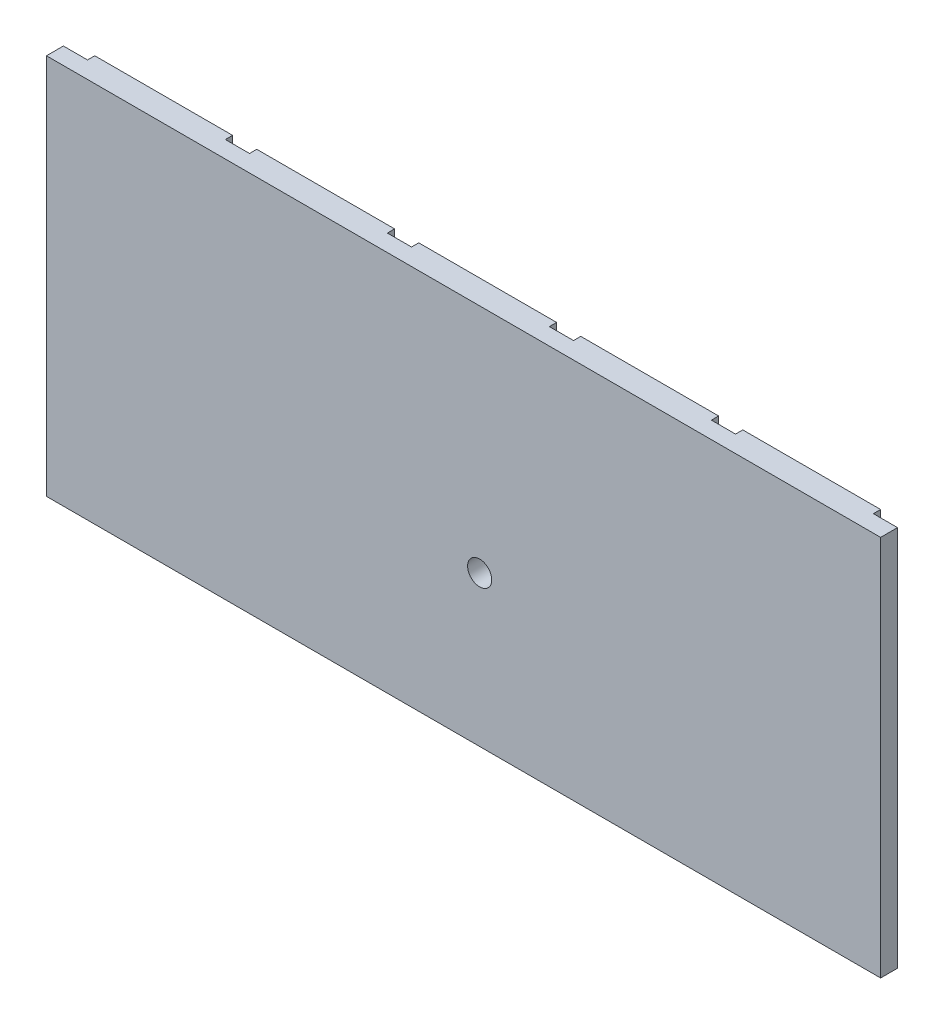
ISO-10303-21;
HEADER;
FILE_DESCRIPTION(('STEP AP214'),'2;1');
FILE_NAME('part.step','',(''),(''),'','','');
FILE_SCHEMA(('AUTOMOTIVE_DESIGN { 1 0 10303 214 1 1 1 1 }'));
ENDSEC;
DATA;
#1=APPLICATION_CONTEXT('core data for automotive mechanical design processes');
#2=APPLICATION_PROTOCOL_DEFINITION('international standard','automotive_design',2000,#1);
#3=PRODUCT_CONTEXT('',#1,'mechanical');
#4=PRODUCT('Part','Part','',(#3));
#5=PRODUCT_RELATED_PRODUCT_CATEGORY('part','',(#4));
#6=PRODUCT_DEFINITION_FORMATION('','',#4);
#7=PRODUCT_DEFINITION_CONTEXT('part definition',#1,'design');
#8=PRODUCT_DEFINITION('design','',#6,#7);
#9=PRODUCT_DEFINITION_SHAPE('','',#8);
#10=(LENGTH_UNIT() NAMED_UNIT(*) SI_UNIT(.MILLI.,.METRE.));
#11=(NAMED_UNIT(*) PLANE_ANGLE_UNIT() SI_UNIT($,.RADIAN.));
#12=(NAMED_UNIT(*) SI_UNIT($,.STERADIAN.) SOLID_ANGLE_UNIT());
#13=UNCERTAINTY_MEASURE_WITH_UNIT(LENGTH_MEASURE(1.E-05),#10,'distance_accuracy_value','');
#14=(GEOMETRIC_REPRESENTATION_CONTEXT(3) GLOBAL_UNCERTAINTY_ASSIGNED_CONTEXT((#13)) GLOBAL_UNIT_ASSIGNED_CONTEXT((#10,
#11,#12)) REPRESENTATION_CONTEXT('',''));
#15=CARTESIAN_POINT('',(0.,0.,0.));
#16=DIRECTION('',(0.,0.,1.));
#17=DIRECTION('',(1.,0.,0.));
#18=AXIS2_PLACEMENT_3D('',#15,#16,#17);
#19=CARTESIAN_POINT('',(0.,0.,0.));
#20=DIRECTION('',(0.,0.,-1.));
#21=DIRECTION('',(-1.,0.,0.));
#22=AXIS2_PLACEMENT_3D('',#19,#20,#21);
#23=PLANE('',#22);
#24=DIRECTION('',(0.,1.,0.));
#25=VECTOR('',#24,1.);
#26=CARTESIAN_POINT('',(-47.8064909033683,-39.501,9.36768929129558E-13));
#27=LINE('',#26,#25);
#28=CARTESIAN_POINT('',(-47.8064909033683,-39.4999999999999,9.36768929129558E-13));
#29=VERTEX_POINT('',#28);
#30=CARTESIAN_POINT('',(-47.8064909033683,39.4999999999999,9.36768929129558E-13));
#31=VERTEX_POINT('',#30);
#32=EDGE_CURVE('E342',#29,#31,#27,.T.);
#33=ORIENTED_EDGE('',*,*,#32,.T.);
#34=DIRECTION('',(-1.,0.,0.));
#35=VECTOR('',#34,1.);
#36=CARTESIAN_POINT('',(-86.3441515056138,39.4999999999999,0.));
#37=LINE('',#36,#35);
#38=CARTESIAN_POINT('',(-19.2688303011227,39.4999999999999,7.03495181946529E-13));
#39=VERTEX_POINT('',#38);
#40=EDGE_CURVE('E377',#39,#31,#37,.T.);
#41=ORIENTED_EDGE('',*,*,#40,.F.);
#42=DIRECTION('',(0.,1.,0.));
#43=VECTOR('',#42,1.);
#44=CARTESIAN_POINT('',(-19.2688303011227,-39.501,7.03495181946529E-13));
#45=LINE('',#44,#43);
#46=CARTESIAN_POINT('',(-19.2688303011228,-39.4999999999999,0.));
#47=VERTEX_POINT('',#46);
#48=EDGE_CURVE('E318',#47,#39,#45,.T.);
#49=ORIENTED_EDGE('',*,*,#48,.F.);
#50=DIRECTION('',(1.,0.,0.));
#51=VECTOR('',#50,1.);
#52=CARTESIAN_POINT('',(-86.3441515056138,-39.4999999999999,0.));
#53=LINE('',#52,#51);
#54=EDGE_CURVE('E228',#29,#47,#53,.T.);
#55=ORIENTED_EDGE('',*,*,#54,.F.);
#56=EDGE_LOOP('',(#33,#41,#49,#55));
#57=FACE_BOUND('',#56,.T.);
#58=ADVANCED_FACE('F35',(#57),#23,.T.);
#59=DIRECTION('',(0.,1.,0.));
#60=VECTOR('',#59,1.);
#61=CARTESIAN_POINT('',(-14.2688303011227,-39.501,7.02576696847169E-13));
#62=LINE('',#61,#60);
#63=CARTESIAN_POINT('',(-14.2688303011227,-39.4999999999999,7.02576696847169E-13));
#64=VERTEX_POINT('',#63);
#65=CARTESIAN_POINT('',(-14.2688303011227,39.4999999999999,7.02576696847169E-13));
#66=VERTEX_POINT('',#65);
#67=EDGE_CURVE('E317',#64,#66,#62,.T.);
#68=ORIENTED_EDGE('',*,*,#67,.T.);
#69=CARTESIAN_POINT('',(14.2688303011228,39.4999999999999,4.6930294966414E-13));
#70=VERTEX_POINT('',#69);
#71=EDGE_CURVE('E379',#70,#66,#37,.T.);
#72=ORIENTED_EDGE('',*,*,#71,.F.);
#73=DIRECTION('',(0.,1.,0.));
#74=VECTOR('',#73,1.);
#75=CARTESIAN_POINT('',(14.2688303011228,-39.501,4.6930294966414E-13));
#76=LINE('',#75,#74);
#77=CARTESIAN_POINT('',(14.2688303011228,-39.4999999999999,0.));
#78=VERTEX_POINT('',#77);
#79=EDGE_CURVE('E293',#78,#70,#76,.T.);
#80=ORIENTED_EDGE('',*,*,#79,.F.);
#81=EDGE_CURVE('E416',#64,#78,#53,.T.);
#82=ORIENTED_EDGE('',*,*,#81,.F.);
#83=EDGE_LOOP('',(#68,#72,#80,#82));
#84=FACE_BOUND('',#83,.T.);
#85=CARTESIAN_POINT('',(3.3372047050014,-8.38677821628897,0.));
#86=DIRECTION('',(0.,0.,1.));
#87=DIRECTION('',(1.,0.,0.));
#88=AXIS2_PLACEMENT_3D('',#85,#86,#87);
#89=CIRCLE('',#88,2.5);
#90=CARTESIAN_POINT('',(5.8372047050014,-8.38677821628897,0.));
#91=VERTEX_POINT('',#90);
#92=EDGE_CURVE('E241',#91,#91,#89,.T.);
#93=ORIENTED_EDGE('',*,*,#92,.T.);
#94=EDGE_LOOP('',(#93));
#95=FACE_BOUND('',#94,.T.);
#96=ADVANCED_FACE('F413',(#84,#95),#23,.T.);
#97=DIRECTION('',(0.,1.,0.));
#98=VECTOR('',#97,1.);
#99=CARTESIAN_POINT('',(19.2688303011228,-39.501,4.68384464564779E-13));
#100=LINE('',#99,#98);
#101=CARTESIAN_POINT('',(19.2688303011228,-39.4999999999999,4.68384464564779E-13));
#102=VERTEX_POINT('',#101);
#103=CARTESIAN_POINT('',(19.2688303011228,39.4999999999999,4.68384464564779E-13));
#104=VERTEX_POINT('',#103);
#105=EDGE_CURVE('E292',#102,#104,#100,.T.);
#106=ORIENTED_EDGE('',*,*,#105,.T.);
#107=CARTESIAN_POINT('',(47.8064909033683,39.4999999999999,2.3511071738175E-13));
#108=VERTEX_POINT('',#107);
#109=EDGE_CURVE('E233',#108,#104,#37,.T.);
#110=ORIENTED_EDGE('',*,*,#109,.F.);
#111=DIRECTION('',(0.,1.,0.));
#112=VECTOR('',#111,1.);
#113=CARTESIAN_POINT('',(47.8064909033683,-39.501,2.3511071738175E-13));
#114=LINE('',#113,#112);
#115=CARTESIAN_POINT('',(47.8064909033683,-39.4999999999999,0.));
#116=VERTEX_POINT('',#115);
#117=EDGE_CURVE('E268',#116,#108,#114,.T.);
#118=ORIENTED_EDGE('',*,*,#117,.F.);
#119=EDGE_CURVE('E397',#102,#116,#53,.T.);
#120=ORIENTED_EDGE('',*,*,#119,.F.);
#121=EDGE_LOOP('',(#106,#110,#118,#120));
#122=FACE_BOUND('',#121,.T.);
#123=ADVANCED_FACE('F395',(#122),#23,.T.);
#124=DIRECTION('',(0.,1.,0.));
#125=VECTOR('',#124,1.);
#126=CARTESIAN_POINT('',(52.8064909033683,-39.501,2.3419223228239E-13));
#127=LINE('',#126,#125);
#128=CARTESIAN_POINT('',(52.8064909033683,-39.4999999999999,2.3419223228239E-13));
#129=VERTEX_POINT('',#128);
#130=CARTESIAN_POINT('',(52.8064909033683,39.4999999999999,2.3419223228239E-13));
#131=VERTEX_POINT('',#130);
#132=EDGE_CURVE('E267',#129,#131,#127,.T.);
#133=ORIENTED_EDGE('',*,*,#132,.T.);
#134=CARTESIAN_POINT('',(81.3441515056138,39.4999999999999,0.));
#135=VERTEX_POINT('',#134);
#136=EDGE_CURVE('E230',#135,#131,#37,.T.);
#137=ORIENTED_EDGE('',*,*,#136,.F.);
#138=DIRECTION('',(0.,1.,0.));
#139=VECTOR('',#138,1.);
#140=CARTESIAN_POINT('',(81.3441515056138,-39.501,0.));
#141=LINE('',#140,#139);
#142=CARTESIAN_POINT('',(81.3441515056138,-39.4999999999999,0.));
#143=VERTEX_POINT('',#142);
#144=EDGE_CURVE('E251',#143,#135,#141,.T.);
#145=ORIENTED_EDGE('',*,*,#144,.F.);
#146=EDGE_CURVE('E229',#129,#143,#53,.T.);
#147=ORIENTED_EDGE('',*,*,#146,.F.);
#148=EDGE_LOOP('',(#133,#137,#145,#147));
#149=FACE_BOUND('',#148,.T.);
#150=ADVANCED_FACE('F455',(#149),#23,.T.);
#151=CARTESIAN_POINT('',(0.,0.,5.));
#152=DIRECTION('',(0.,0.,-1.));
#153=DIRECTION('',(-1.,0.,0.));
#154=AXIS2_PLACEMENT_3D('',#151,#152,#153);
#155=PLANE('',#154);
#156=DIRECTION('',(0.,1.,0.));
#157=VECTOR('',#156,1.);
#158=CARTESIAN_POINT('',(86.3441515056138,-39.4999999999999,5.));
#159=LINE('',#158,#157);
#160=CARTESIAN_POINT('',(86.3441515056138,-39.4999999999999,5.));
#161=VERTEX_POINT('',#160);
#162=CARTESIAN_POINT('',(86.3441515056138,39.4999999999999,5.));
#163=VERTEX_POINT('',#162);
#164=EDGE_CURVE('E227',#161,#163,#159,.T.);
#165=ORIENTED_EDGE('',*,*,#164,.T.);
#166=DIRECTION('',(-1.,0.,0.));
#167=VECTOR('',#166,1.);
#168=CARTESIAN_POINT('',(-86.3441515056138,39.4999999999999,5.));
#169=LINE('',#168,#167);
#170=CARTESIAN_POINT('',(-86.3441515056138,39.4999999999999,5.));
#171=VERTEX_POINT('',#170);
#172=EDGE_CURVE('E237',#163,#171,#169,.T.);
#173=ORIENTED_EDGE('',*,*,#172,.T.);
#174=DIRECTION('',(0.,-1.,0.));
#175=VECTOR('',#174,1.);
#176=CARTESIAN_POINT('',(-86.3441515056138,-39.4999999999999,5.));
#177=LINE('',#176,#175);
#178=CARTESIAN_POINT('',(-86.3441515056138,-39.4999999999999,5.));
#179=VERTEX_POINT('',#178);
#180=EDGE_CURVE('E217',#171,#179,#177,.T.);
#181=ORIENTED_EDGE('',*,*,#180,.T.);
#182=DIRECTION('',(1.,0.,0.));
#183=VECTOR('',#182,1.);
#184=CARTESIAN_POINT('',(-86.3441515056138,-39.4999999999999,5.));
#185=LINE('',#184,#183);
#186=EDGE_CURVE('E224',#179,#161,#185,.T.);
#187=ORIENTED_EDGE('',*,*,#186,.T.);
#188=EDGE_LOOP('',(#165,#173,#181,#187));
#189=FACE_BOUND('',#188,.T.);
#190=CARTESIAN_POINT('',(3.3372047050014,-8.38677821628897,5.));
#191=DIRECTION('',(0.,0.,1.));
#192=DIRECTION('',(1.,0.,0.));
#193=AXIS2_PLACEMENT_3D('',#190,#191,#192);
#194=CIRCLE('',#193,2.5);
#195=CARTESIAN_POINT('',(5.8372047050014,-8.38677821628897,5.));
#196=VERTEX_POINT('',#195);
#197=EDGE_CURVE('E244',#196,#196,#194,.T.);
#198=ORIENTED_EDGE('',*,*,#197,.F.);
#199=EDGE_LOOP('',(#198));
#200=FACE_BOUND('',#199,.T.);
#201=ADVANCED_FACE('F454',(#189,#200),#155,.F.);
#202=DIRECTION('',(0.,1.,0.));
#203=VECTOR('',#202,1.);
#204=CARTESIAN_POINT('',(-81.3441515056138,-39.501,1.17096116141195E-12));
#205=LINE('',#204,#203);
#206=CARTESIAN_POINT('',(-81.3441515056138,-39.4999999999999,1.17096116141195E-12));
#207=VERTEX_POINT('',#206);
#208=CARTESIAN_POINT('',(-81.3441515056138,39.4999999999999,1.17096116141195E-12));
#209=VERTEX_POINT('',#208);
#210=EDGE_CURVE('E362',#207,#209,#205,.T.);
#211=ORIENTED_EDGE('',*,*,#210,.T.);
#212=CARTESIAN_POINT('',(-52.8064909033683,39.4999999999999,9.37687414228919E-13));
#213=VERTEX_POINT('',#212);
#214=EDGE_CURVE('E234',#213,#209,#37,.T.);
#215=ORIENTED_EDGE('',*,*,#214,.F.);
#216=DIRECTION('',(0.,1.,0.));
#217=VECTOR('',#216,1.);
#218=CARTESIAN_POINT('',(-52.8064909033683,-39.501,9.37687414228919E-13));
#219=LINE('',#218,#217);
#220=CARTESIAN_POINT('',(-52.8064909033683,-39.4999999999999,0.));
#221=VERTEX_POINT('',#220);
#222=EDGE_CURVE('E343',#221,#213,#219,.T.);
#223=ORIENTED_EDGE('',*,*,#222,.F.);
#224=EDGE_CURVE('E225',#207,#221,#53,.T.);
#225=ORIENTED_EDGE('',*,*,#224,.F.);
#226=EDGE_LOOP('',(#211,#215,#223,#225));
#227=FACE_BOUND('',#226,.T.);
#228=ADVANCED_FACE('F373',(#227),#23,.T.);
#229=CARTESIAN_POINT('',(86.3441515056138,-39.4999999999999,5.));
#230=DIRECTION('',(-1.,0.,0.));
#231=DIRECTION('',(0.,-1.,0.));
#232=AXIS2_PLACEMENT_3D('',#229,#230,#231);
#233=PLANE('',#232);
#234=DIRECTION('',(0.,0.,-1.));
#235=VECTOR('',#234,1.);
#236=CARTESIAN_POINT('',(86.3441515056138,-39.4999999999999,5.));
#237=LINE('',#236,#235);
#238=CARTESIAN_POINT('',(86.3441515056138,-39.4999999999999,1.5));
#239=VERTEX_POINT('',#238);
#240=EDGE_CURVE('E219',#161,#239,#237,.T.);
#241=ORIENTED_EDGE('',*,*,#240,.T.);
#242=DIRECTION('',(0.,1.,0.));
#243=VECTOR('',#242,1.);
#244=CARTESIAN_POINT('',(86.3441515056138,-39.501,1.5));
#245=LINE('',#244,#243);
#246=CARTESIAN_POINT('',(86.3441515056138,39.4999999999999,1.5));
#247=VERTEX_POINT('',#246);
#248=EDGE_CURVE('E250',#239,#247,#245,.T.);
#249=ORIENTED_EDGE('',*,*,#248,.T.);
#250=DIRECTION('',(0.,0.,-1.));
#251=VECTOR('',#250,1.);
#252=CARTESIAN_POINT('',(86.3441515056138,39.4999999999999,5.));
#253=LINE('',#252,#251);
#254=EDGE_CURVE('E11',#163,#247,#253,.T.);
#255=ORIENTED_EDGE('',*,*,#254,.F.);
#256=ORIENTED_EDGE('',*,*,#164,.F.);
#257=EDGE_LOOP('',(#241,#249,#255,#256));
#258=FACE_BOUND('',#257,.T.);
#259=ADVANCED_FACE('F37',(#258),#233,.F.);
#260=CARTESIAN_POINT('',(-86.3441515056138,39.4999999999999,5.));
#261=DIRECTION('',(0.,-1.,0.));
#262=DIRECTION('',(1.,0.,0.));
#263=AXIS2_PLACEMENT_3D('',#260,#261,#262);
#264=PLANE('',#263);
#265=ORIENTED_EDGE('',*,*,#214,.T.);
#266=DIRECTION('',(0.,0.,-1.));
#267=VECTOR('',#266,1.);
#268=CARTESIAN_POINT('',(-81.3441515056138,39.4999999999999,1.17096116141195E-12));
#269=LINE('',#268,#267);
#270=CARTESIAN_POINT('',(-81.3441515056138,39.4999999999999,1.50000000000117));
#271=VERTEX_POINT('',#270);
#272=EDGE_CURVE('E208',#271,#209,#269,.T.);
#273=ORIENTED_EDGE('',*,*,#272,.F.);
#274=DIRECTION('',(1.,0.,0.));
#275=VECTOR('',#274,1.);
#276=CARTESIAN_POINT('',(-81.3441515056138,39.4999999999999,1.50000000000117));
#277=LINE('',#276,#275);
#278=CARTESIAN_POINT('',(-86.3441515056138,39.4999999999999,1.50000000000119));
#279=VERTEX_POINT('',#278);
#280=EDGE_CURVE('E199',#279,#271,#277,.T.);
#281=ORIENTED_EDGE('',*,*,#280,.F.);
#282=DIRECTION('',(0.,0.,-1.));
#283=VECTOR('',#282,1.);
#284=CARTESIAN_POINT('',(-86.3441515056138,39.4999999999999,5.));
#285=LINE('',#284,#283);
#286=EDGE_CURVE('E43',#171,#279,#285,.T.);
#287=ORIENTED_EDGE('',*,*,#286,.F.);
#288=ORIENTED_EDGE('',*,*,#172,.F.);
#289=ORIENTED_EDGE('',*,*,#254,.T.);
#290=DIRECTION('',(1.,0.,0.));
#291=VECTOR('',#290,1.);
#292=CARTESIAN_POINT('',(86.3441515056138,39.4999999999999,1.5));
#293=LINE('',#292,#291);
#294=CARTESIAN_POINT('',(81.3441515056138,39.4999999999999,1.5));
#295=VERTEX_POINT('',#294);
#296=EDGE_CURVE('E254',#295,#247,#293,.T.);
#297=ORIENTED_EDGE('',*,*,#296,.F.);
#298=DIRECTION('',(0.,0.,1.));
#299=VECTOR('',#298,1.);
#300=CARTESIAN_POINT('',(81.3441515056138,39.4999999999999,0.));
#301=LINE('',#300,#299);
#302=EDGE_CURVE('E259',#135,#295,#301,.T.);
#303=ORIENTED_EDGE('',*,*,#302,.F.);
#304=ORIENTED_EDGE('',*,*,#136,.T.);
#305=DIRECTION('',(0.,0.,-1.));
#306=VECTOR('',#305,1.);
#307=CARTESIAN_POINT('',(52.8064909033683,39.4999999999999,2.3419223228239E-13));
#308=LINE('',#307,#306);
#309=CARTESIAN_POINT('',(52.8064909033683,39.4999999999999,1.50000000000023));
#310=VERTEX_POINT('',#309);
#311=EDGE_CURVE('E271',#310,#131,#308,.T.);
#312=ORIENTED_EDGE('',*,*,#311,.F.);
#313=DIRECTION('',(1.,0.,0.));
#314=VECTOR('',#313,1.);
#315=CARTESIAN_POINT('',(52.8064909033683,39.4999999999999,1.50000000000023));
#316=LINE('',#315,#314);
#317=CARTESIAN_POINT('',(47.8064909033683,39.4999999999999,1.50000000000024));
#318=VERTEX_POINT('',#317);
#319=EDGE_CURVE('E278',#318,#310,#316,.T.);
#320=ORIENTED_EDGE('',*,*,#319,.F.);
#321=DIRECTION('',(0.,0.,1.));
#322=VECTOR('',#321,1.);
#323=CARTESIAN_POINT('',(47.8064909033683,39.4999999999999,2.3511071738175E-13));
#324=LINE('',#323,#322);
#325=EDGE_CURVE('E281',#108,#318,#324,.T.);
#326=ORIENTED_EDGE('',*,*,#325,.F.);
#327=ORIENTED_EDGE('',*,*,#109,.T.);
#328=DIRECTION('',(0.,0.,-1.));
#329=VECTOR('',#328,1.);
#330=CARTESIAN_POINT('',(19.2688303011228,39.4999999999999,4.68384464564779E-13));
#331=LINE('',#330,#329);
#332=CARTESIAN_POINT('',(19.2688303011228,39.4999999999999,1.50000000000047));
#333=VERTEX_POINT('',#332);
#334=EDGE_CURVE('E296',#333,#104,#331,.T.);
#335=ORIENTED_EDGE('',*,*,#334,.F.);
#336=DIRECTION('',(1.,0.,0.));
#337=VECTOR('',#336,1.);
#338=CARTESIAN_POINT('',(19.2688303011228,39.4999999999999,1.50000000000047));
#339=LINE('',#338,#337);
#340=CARTESIAN_POINT('',(14.2688303011228,39.4999999999999,1.50000000000047));
#341=VERTEX_POINT('',#340);
#342=EDGE_CURVE('E303',#341,#333,#339,.T.);
#343=ORIENTED_EDGE('',*,*,#342,.F.);
#344=DIRECTION('',(0.,0.,1.));
#345=VECTOR('',#344,1.);
#346=CARTESIAN_POINT('',(14.2688303011228,39.4999999999999,4.6930294966414E-13));
#347=LINE('',#346,#345);
#348=EDGE_CURVE('E306',#70,#341,#347,.T.);
#349=ORIENTED_EDGE('',*,*,#348,.F.);
#350=ORIENTED_EDGE('',*,*,#71,.T.);
#351=DIRECTION('',(0.,0.,-1.));
#352=VECTOR('',#351,1.);
#353=CARTESIAN_POINT('',(-14.2688303011227,39.4999999999999,7.02576696847169E-13));
#354=LINE('',#353,#352);
#355=CARTESIAN_POINT('',(-14.2688303011227,39.4999999999999,1.5000000000007));
#356=VERTEX_POINT('',#355);
#357=EDGE_CURVE('E321',#356,#66,#354,.T.);
#358=ORIENTED_EDGE('',*,*,#357,.F.);
#359=DIRECTION('',(1.,0.,0.));
#360=VECTOR('',#359,1.);
#361=CARTESIAN_POINT('',(-14.2688303011227,39.4999999999999,1.5000000000007));
#362=LINE('',#361,#360);
#363=CARTESIAN_POINT('',(-19.2688303011227,39.4999999999999,1.5000000000007));
#364=VERTEX_POINT('',#363);
#365=EDGE_CURVE('E328',#364,#356,#362,.T.);
#366=ORIENTED_EDGE('',*,*,#365,.F.);
#367=DIRECTION('',(0.,0.,1.));
#368=VECTOR('',#367,1.);
#369=CARTESIAN_POINT('',(-19.2688303011227,39.4999999999999,7.03495181946529E-13));
#370=LINE('',#369,#368);
#371=EDGE_CURVE('E331',#39,#364,#370,.T.);
#372=ORIENTED_EDGE('',*,*,#371,.F.);
#373=ORIENTED_EDGE('',*,*,#40,.T.);
#374=DIRECTION('',(0.,0.,-1.));
#375=VECTOR('',#374,1.);
#376=CARTESIAN_POINT('',(-47.8064909033683,39.4999999999999,9.36768929129558E-13));
#377=LINE('',#376,#375);
#378=CARTESIAN_POINT('',(-47.8064909033683,39.4999999999999,1.50000000000094));
#379=VERTEX_POINT('',#378);
#380=EDGE_CURVE('E346',#379,#31,#377,.T.);
#381=ORIENTED_EDGE('',*,*,#380,.F.);
#382=DIRECTION('',(1.,0.,0.));
#383=VECTOR('',#382,1.);
#384=CARTESIAN_POINT('',(-47.8064909033683,39.4999999999999,1.50000000000094));
#385=LINE('',#384,#383);
#386=CARTESIAN_POINT('',(-52.8064909033683,39.4999999999999,1.50000000000094));
#387=VERTEX_POINT('',#386);
#388=EDGE_CURVE('E353',#387,#379,#385,.T.);
#389=ORIENTED_EDGE('',*,*,#388,.F.);
#390=DIRECTION('',(0.,0.,1.));
#391=VECTOR('',#390,1.);
#392=CARTESIAN_POINT('',(-52.8064909033683,39.4999999999999,9.37687414228919E-13));
#393=LINE('',#392,#391);
#394=EDGE_CURVE('E356',#213,#387,#393,.T.);
#395=ORIENTED_EDGE('',*,*,#394,.F.);
#396=EDGE_LOOP('',(#265,#273,#281,#287,#288,#289,#297,#303,#304,#312,#320,#326,#327,#335,#343,
#349,#350,#358,#366,#372,#373,#381,#389,#395));
#397=FACE_BOUND('',#396,.T.);
#398=ADVANCED_FACE('F213',(#397),#264,.F.);
#399=CARTESIAN_POINT('',(-86.3441515056138,-39.4999999999999,5.));
#400=DIRECTION('',(1.,0.,0.));
#401=DIRECTION('',(0.,1.,0.));
#402=AXIS2_PLACEMENT_3D('',#399,#400,#401);
#403=PLANE('',#402);
#404=ORIENTED_EDGE('',*,*,#286,.T.);
#405=DIRECTION('',(0.,1.,0.));
#406=VECTOR('',#405,1.);
#407=CARTESIAN_POINT('',(-86.3441515056138,-39.501,1.50000000000119));
#408=LINE('',#407,#406);
#409=CARTESIAN_POINT('',(-86.3441515056138,-39.4999999999999,1.50000000000119));
#410=VERTEX_POINT('',#409);
#411=EDGE_CURVE('E196',#410,#279,#408,.T.);
#412=ORIENTED_EDGE('',*,*,#411,.F.);
#413=DIRECTION('',(0.,0.,-1.));
#414=VECTOR('',#413,1.);
#415=CARTESIAN_POINT('',(-86.3441515056138,-39.4999999999999,5.));
#416=LINE('',#415,#414);
#417=EDGE_CURVE('E218',#179,#410,#416,.T.);
#418=ORIENTED_EDGE('',*,*,#417,.F.);
#419=ORIENTED_EDGE('',*,*,#180,.F.);
#420=EDGE_LOOP('',(#404,#412,#418,#419));
#421=FACE_BOUND('',#420,.T.);
#422=ADVANCED_FACE('F216',(#421),#403,.F.);
#423=CARTESIAN_POINT('',(-86.3441515056138,-39.4999999999999,5.));
#424=DIRECTION('',(0.,1.,0.));
#425=DIRECTION('',(0.,0.,1.));
#426=AXIS2_PLACEMENT_3D('',#423,#424,#425);
#427=PLANE('',#426);
#428=DIRECTION('',(-1.,0.,0.));
#429=VECTOR('',#428,1.);
#430=CARTESIAN_POINT('',(-81.3441515056138,-39.4999999999999,1.50000000000117));
#431=LINE('',#430,#429);
#432=CARTESIAN_POINT('',(-81.3441515056138,-39.4999999999999,1.50000000000117));
#433=VERTEX_POINT('',#432);
#434=EDGE_CURVE('E202',#433,#410,#431,.T.);
#435=ORIENTED_EDGE('',*,*,#434,.F.);
#436=DIRECTION('',(0.,0.,1.));
#437=VECTOR('',#436,1.);
#438=CARTESIAN_POINT('',(-81.3441515056138,-39.4999999999999,1.17096116141195E-12));
#439=LINE('',#438,#437);
#440=EDGE_CURVE('E50',#207,#433,#439,.T.);
#441=ORIENTED_EDGE('',*,*,#440,.F.);
#442=ORIENTED_EDGE('',*,*,#224,.T.);
#443=DIRECTION('',(0.,0.,-1.));
#444=VECTOR('',#443,1.);
#445=CARTESIAN_POINT('',(-52.8064909033683,-39.4999999999999,9.37687414228919E-13));
#446=LINE('',#445,#444);
#447=CARTESIAN_POINT('',(-52.8064909033683,-39.4999999999999,1.50000000000094));
#448=VERTEX_POINT('',#447);
#449=EDGE_CURVE('E339',#448,#221,#446,.T.);
#450=ORIENTED_EDGE('',*,*,#449,.F.);
#451=DIRECTION('',(-1.,0.,0.));
#452=VECTOR('',#451,1.);
#453=CARTESIAN_POINT('',(-47.8064909033683,-39.4999999999999,1.50000000000094));
#454=LINE('',#453,#452);
#455=CARTESIAN_POINT('',(-47.8064909033683,-39.4999999999999,1.50000000000094));
#456=VERTEX_POINT('',#455);
#457=EDGE_CURVE('E58',#456,#448,#454,.T.);
#458=ORIENTED_EDGE('',*,*,#457,.F.);
#459=DIRECTION('',(0.,0.,1.));
#460=VECTOR('',#459,1.);
#461=CARTESIAN_POINT('',(-47.8064909033683,-39.4999999999999,9.36768929129558E-13));
#462=LINE('',#461,#460);
#463=EDGE_CURVE('E359',#29,#456,#462,.T.);
#464=ORIENTED_EDGE('',*,*,#463,.F.);
#465=ORIENTED_EDGE('',*,*,#54,.T.);
#466=DIRECTION('',(0.,0.,-1.));
#467=VECTOR('',#466,1.);
#468=CARTESIAN_POINT('',(-19.2688303011227,-39.4999999999999,7.03495181946529E-13));
#469=LINE('',#468,#467);
#470=CARTESIAN_POINT('',(-19.2688303011228,-39.4999999999999,1.5000000000007));
#471=VERTEX_POINT('',#470);
#472=EDGE_CURVE('E314',#471,#47,#469,.T.);
#473=ORIENTED_EDGE('',*,*,#472,.F.);
#474=DIRECTION('',(-1.,0.,0.));
#475=VECTOR('',#474,1.);
#476=CARTESIAN_POINT('',(-14.2688303011227,-39.4999999999999,1.5000000000007));
#477=LINE('',#476,#475);
#478=CARTESIAN_POINT('',(-14.2688303011227,-39.4999999999999,1.5000000000007));
#479=VERTEX_POINT('',#478);
#480=EDGE_CURVE('E337',#479,#471,#477,.T.);
#481=ORIENTED_EDGE('',*,*,#480,.F.);
#482=DIRECTION('',(0.,0.,1.));
#483=VECTOR('',#482,1.);
#484=CARTESIAN_POINT('',(-14.2688303011227,-39.4999999999999,7.02576696847169E-13));
#485=LINE('',#484,#483);
#486=EDGE_CURVE('E334',#64,#479,#485,.T.);
#487=ORIENTED_EDGE('',*,*,#486,.F.);
#488=ORIENTED_EDGE('',*,*,#81,.T.);
#489=DIRECTION('',(0.,0.,-1.));
#490=VECTOR('',#489,1.);
#491=CARTESIAN_POINT('',(14.2688303011228,-39.4999999999999,4.6930294966414E-13));
#492=LINE('',#491,#490);
#493=CARTESIAN_POINT('',(14.2688303011228,-39.4999999999999,1.50000000000047));
#494=VERTEX_POINT('',#493);
#495=EDGE_CURVE('E289',#494,#78,#492,.T.);
#496=ORIENTED_EDGE('',*,*,#495,.F.);
#497=DIRECTION('',(-1.,0.,0.));
#498=VECTOR('',#497,1.);
#499=CARTESIAN_POINT('',(19.2688303011228,-39.4999999999999,1.50000000000047));
#500=LINE('',#499,#498);
#501=CARTESIAN_POINT('',(19.2688303011228,-39.4999999999999,1.50000000000047));
#502=VERTEX_POINT('',#501);
#503=EDGE_CURVE('E312',#502,#494,#500,.T.);
#504=ORIENTED_EDGE('',*,*,#503,.F.);
#505=DIRECTION('',(0.,0.,1.));
#506=VECTOR('',#505,1.);
#507=CARTESIAN_POINT('',(19.2688303011228,-39.4999999999999,4.68384464564779E-13));
#508=LINE('',#507,#506);
#509=EDGE_CURVE('E309',#102,#502,#508,.T.);
#510=ORIENTED_EDGE('',*,*,#509,.F.);
#511=ORIENTED_EDGE('',*,*,#119,.T.);
#512=DIRECTION('',(0.,0.,-1.));
#513=VECTOR('',#512,1.);
#514=CARTESIAN_POINT('',(47.8064909033683,-39.4999999999999,2.3511071738175E-13));
#515=LINE('',#514,#513);
#516=CARTESIAN_POINT('',(47.8064909033683,-39.4999999999999,1.50000000000024));
#517=VERTEX_POINT('',#516);
#518=EDGE_CURVE('E264',#517,#116,#515,.T.);
#519=ORIENTED_EDGE('',*,*,#518,.F.);
#520=DIRECTION('',(-1.,0.,0.));
#521=VECTOR('',#520,1.);
#522=CARTESIAN_POINT('',(52.8064909033683,-39.4999999999999,1.50000000000023));
#523=LINE('',#522,#521);
#524=CARTESIAN_POINT('',(52.8064909033683,-39.4999999999999,1.50000000000023));
#525=VERTEX_POINT('',#524);
#526=EDGE_CURVE('E287',#525,#517,#523,.T.);
#527=ORIENTED_EDGE('',*,*,#526,.F.);
#528=DIRECTION('',(0.,0.,1.));
#529=VECTOR('',#528,1.);
#530=CARTESIAN_POINT('',(52.8064909033683,-39.4999999999999,2.3419223228239E-13));
#531=LINE('',#530,#529);
#532=EDGE_CURVE('E284',#129,#525,#531,.T.);
#533=ORIENTED_EDGE('',*,*,#532,.F.);
#534=ORIENTED_EDGE('',*,*,#146,.T.);
#535=DIRECTION('',(0.,0.,-1.));
#536=VECTOR('',#535,1.);
#537=CARTESIAN_POINT('',(81.3441515056138,-39.4999999999999,0.));
#538=LINE('',#537,#536);
#539=CARTESIAN_POINT('',(81.3441515056138,-39.4999999999999,1.5));
#540=VERTEX_POINT('',#539);
#541=EDGE_CURVE('E245',#540,#143,#538,.T.);
#542=ORIENTED_EDGE('',*,*,#541,.F.);
#543=DIRECTION('',(-1.,0.,0.));
#544=VECTOR('',#543,1.);
#545=CARTESIAN_POINT('',(86.3441515056138,-39.4999999999999,1.5));
#546=LINE('',#545,#544);
#547=EDGE_CURVE('E262',#239,#540,#546,.T.);
#548=ORIENTED_EDGE('',*,*,#547,.F.);
#549=ORIENTED_EDGE('',*,*,#240,.F.);
#550=ORIENTED_EDGE('',*,*,#186,.F.);
#551=ORIENTED_EDGE('',*,*,#417,.T.);
#552=EDGE_LOOP('',(#435,#441,#442,#450,#458,#464,#465,#473,#481,#487,#488,#496,#504,#510,#511,
#519,#527,#533,#534,#542,#548,#549,#550,#551));
#553=FACE_BOUND('',#552,.T.);
#554=ADVANCED_FACE('F403',(#553),#427,.F.);
#555=CARTESIAN_POINT('',(3.3372047050014,-8.38677821628897,5.));
#556=DIRECTION('',(0.,0.,-1.));
#557=DIRECTION('',(-1.,0.,0.));
#558=AXIS2_PLACEMENT_3D('',#555,#556,#557);
#559=CYLINDRICAL_SURFACE('',#558,2.5);
#560=ORIENTED_EDGE('',*,*,#197,.T.);
#561=EDGE_LOOP('',(#560));
#562=FACE_BOUND('',#561,.T.);
#563=ORIENTED_EDGE('',*,*,#92,.F.);
#564=EDGE_LOOP('',(#563));
#565=FACE_BOUND('',#564,.T.);
#566=ADVANCED_FACE('F501',(#562,#565),#559,.F.);
#567=CARTESIAN_POINT('',(86.3441515056138,-39.501,1.5));
#568=DIRECTION('',(0.,0.,1.));
#569=DIRECTION('',(1.,0.,0.));
#570=AXIS2_PLACEMENT_3D('',#567,#568,#569);
#571=PLANE('',#570);
#572=ORIENTED_EDGE('',*,*,#547,.T.);
#573=DIRECTION('',(0.,1.,0.));
#574=VECTOR('',#573,1.);
#575=CARTESIAN_POINT('',(81.3441515056138,-39.501,1.5));
#576=LINE('',#575,#574);
#577=EDGE_CURVE('E253',#540,#295,#576,.T.);
#578=ORIENTED_EDGE('',*,*,#577,.T.);
#579=ORIENTED_EDGE('',*,*,#296,.T.);
#580=ORIENTED_EDGE('',*,*,#248,.F.);
#581=EDGE_LOOP('',(#572,#578,#579,#580));
#582=FACE_BOUND('',#581,.T.);
#583=ADVANCED_FACE('F498',(#582),#571,.F.);
#584=CARTESIAN_POINT('',(81.3441515056138,-39.501,0.));
#585=DIRECTION('',(-1.,0.,0.));
#586=DIRECTION('',(0.,0.,1.));
#587=AXIS2_PLACEMENT_3D('',#584,#585,#586);
#588=PLANE('',#587);
#589=ORIENTED_EDGE('',*,*,#541,.T.);
#590=ORIENTED_EDGE('',*,*,#144,.T.);
#591=ORIENTED_EDGE('',*,*,#302,.T.);
#592=ORIENTED_EDGE('',*,*,#577,.F.);
#593=EDGE_LOOP('',(#589,#590,#591,#592));
#594=FACE_BOUND('',#593,.T.);
#595=ADVANCED_FACE('F477',(#594),#588,.F.);
#596=CARTESIAN_POINT('',(52.8064909033683,-39.501,2.3419223228239E-13));
#597=DIRECTION('',(1.,0.,0.));
#598=DIRECTION('',(0.,0.,-1.));
#599=AXIS2_PLACEMENT_3D('',#596,#597,#598);
#600=PLANE('',#599);
#601=ORIENTED_EDGE('',*,*,#532,.T.);
#602=DIRECTION('',(0.,1.,0.));
#603=VECTOR('',#602,1.);
#604=CARTESIAN_POINT('',(52.8064909033683,-39.501,1.50000000000023));
#605=LINE('',#604,#603);
#606=EDGE_CURVE('E273',#525,#310,#605,.T.);
#607=ORIENTED_EDGE('',*,*,#606,.T.);
#608=ORIENTED_EDGE('',*,*,#311,.T.);
#609=ORIENTED_EDGE('',*,*,#132,.F.);
#610=EDGE_LOOP('',(#601,#607,#608,#609));
#611=FACE_BOUND('',#610,.T.);
#612=ADVANCED_FACE('F482',(#611),#600,.F.);
#613=CARTESIAN_POINT('',(52.8064909033683,-39.501,1.50000000000023));
#614=DIRECTION('',(0.,0.,1.));
#615=DIRECTION('',(1.,0.,0.));
#616=AXIS2_PLACEMENT_3D('',#613,#614,#615);
#617=PLANE('',#616);
#618=ORIENTED_EDGE('',*,*,#526,.T.);
#619=DIRECTION('',(0.,1.,0.));
#620=VECTOR('',#619,1.);
#621=CARTESIAN_POINT('',(47.8064909033683,-39.501,1.50000000000024));
#622=LINE('',#621,#620);
#623=EDGE_CURVE('E270',#517,#318,#622,.T.);
#624=ORIENTED_EDGE('',*,*,#623,.T.);
#625=ORIENTED_EDGE('',*,*,#319,.T.);
#626=ORIENTED_EDGE('',*,*,#606,.F.);
#627=EDGE_LOOP('',(#618,#624,#625,#626));
#628=FACE_BOUND('',#627,.T.);
#629=ADVANCED_FACE('F484',(#628),#617,.F.);
#630=CARTESIAN_POINT('',(47.8064909033683,-39.501,2.3511071738175E-13));
#631=DIRECTION('',(-1.,0.,0.));
#632=DIRECTION('',(0.,0.,1.));
#633=AXIS2_PLACEMENT_3D('',#630,#631,#632);
#634=PLANE('',#633);
#635=ORIENTED_EDGE('',*,*,#518,.T.);
#636=ORIENTED_EDGE('',*,*,#117,.T.);
#637=ORIENTED_EDGE('',*,*,#325,.T.);
#638=ORIENTED_EDGE('',*,*,#623,.F.);
#639=EDGE_LOOP('',(#635,#636,#637,#638));
#640=FACE_BOUND('',#639,.T.);
#641=ADVANCED_FACE('F487',(#640),#634,.F.);
#642=CARTESIAN_POINT('',(19.2688303011228,-39.501,4.68384464564779E-13));
#643=DIRECTION('',(1.,0.,0.));
#644=DIRECTION('',(0.,0.,-1.));
#645=AXIS2_PLACEMENT_3D('',#642,#643,#644);
#646=PLANE('',#645);
#647=ORIENTED_EDGE('',*,*,#509,.T.);
#648=DIRECTION('',(0.,1.,0.));
#649=VECTOR('',#648,1.);
#650=CARTESIAN_POINT('',(19.2688303011228,-39.501,1.50000000000047));
#651=LINE('',#650,#649);
#652=EDGE_CURVE('E298',#502,#333,#651,.T.);
#653=ORIENTED_EDGE('',*,*,#652,.T.);
#654=ORIENTED_EDGE('',*,*,#334,.T.);
#655=ORIENTED_EDGE('',*,*,#105,.F.);
#656=EDGE_LOOP('',(#647,#653,#654,#655));
#657=FACE_BOUND('',#656,.T.);
#658=ADVANCED_FACE('F400',(#657),#646,.F.);
#659=CARTESIAN_POINT('',(19.2688303011228,-39.501,1.50000000000047));
#660=DIRECTION('',(0.,0.,1.));
#661=DIRECTION('',(1.,0.,0.));
#662=AXIS2_PLACEMENT_3D('',#659,#660,#661);
#663=PLANE('',#662);
#664=ORIENTED_EDGE('',*,*,#503,.T.);
#665=DIRECTION('',(0.,1.,0.));
#666=VECTOR('',#665,1.);
#667=CARTESIAN_POINT('',(14.2688303011228,-39.501,1.50000000000047));
#668=LINE('',#667,#666);
#669=EDGE_CURVE('E295',#494,#341,#668,.T.);
#670=ORIENTED_EDGE('',*,*,#669,.T.);
#671=ORIENTED_EDGE('',*,*,#342,.T.);
#672=ORIENTED_EDGE('',*,*,#652,.F.);
#673=EDGE_LOOP('',(#664,#670,#671,#672));
#674=FACE_BOUND('',#673,.T.);
#675=ADVANCED_FACE('F408',(#674),#663,.F.);
#676=CARTESIAN_POINT('',(14.2688303011228,-39.501,4.6930294966414E-13));
#677=DIRECTION('',(-1.,0.,0.));
#678=DIRECTION('',(0.,0.,1.));
#679=AXIS2_PLACEMENT_3D('',#676,#677,#678);
#680=PLANE('',#679);
#681=ORIENTED_EDGE('',*,*,#495,.T.);
#682=ORIENTED_EDGE('',*,*,#79,.T.);
#683=ORIENTED_EDGE('',*,*,#348,.T.);
#684=ORIENTED_EDGE('',*,*,#669,.F.);
#685=EDGE_LOOP('',(#681,#682,#683,#684));
#686=FACE_BOUND('',#685,.T.);
#687=ADVANCED_FACE('F410',(#686),#680,.F.);
#688=CARTESIAN_POINT('',(-14.2688303011227,-39.501,7.02576696847169E-13));
#689=DIRECTION('',(1.,0.,0.));
#690=DIRECTION('',(0.,0.,-1.));
#691=AXIS2_PLACEMENT_3D('',#688,#689,#690);
#692=PLANE('',#691);
#693=ORIENTED_EDGE('',*,*,#486,.T.);
#694=DIRECTION('',(0.,1.,0.));
#695=VECTOR('',#694,1.);
#696=CARTESIAN_POINT('',(-14.2688303011227,-39.501,1.5000000000007));
#697=LINE('',#696,#695);
#698=EDGE_CURVE('E323',#479,#356,#697,.T.);
#699=ORIENTED_EDGE('',*,*,#698,.T.);
#700=ORIENTED_EDGE('',*,*,#357,.T.);
#701=ORIENTED_EDGE('',*,*,#67,.F.);
#702=EDGE_LOOP('',(#693,#699,#700,#701));
#703=FACE_BOUND('',#702,.T.);
#704=ADVANCED_FACE('F419',(#703),#692,.F.);
#705=CARTESIAN_POINT('',(-14.2688303011227,-39.501,1.5000000000007));
#706=DIRECTION('',(0.,0.,1.));
#707=DIRECTION('',(1.,0.,0.));
#708=AXIS2_PLACEMENT_3D('',#705,#706,#707);
#709=PLANE('',#708);
#710=ORIENTED_EDGE('',*,*,#480,.T.);
#711=DIRECTION('',(0.,1.,0.));
#712=VECTOR('',#711,1.);
#713=CARTESIAN_POINT('',(-19.2688303011227,-39.501,1.5000000000007));
#714=LINE('',#713,#712);
#715=EDGE_CURVE('E320',#471,#364,#714,.T.);
#716=ORIENTED_EDGE('',*,*,#715,.T.);
#717=ORIENTED_EDGE('',*,*,#365,.T.);
#718=ORIENTED_EDGE('',*,*,#698,.F.);
#719=EDGE_LOOP('',(#710,#716,#717,#718));
#720=FACE_BOUND('',#719,.T.);
#721=ADVANCED_FACE('F424',(#720),#709,.F.);
#722=CARTESIAN_POINT('',(-19.2688303011227,-39.501,7.03495181946529E-13));
#723=DIRECTION('',(-1.,0.,0.));
#724=DIRECTION('',(0.,0.,1.));
#725=AXIS2_PLACEMENT_3D('',#722,#723,#724);
#726=PLANE('',#725);
#727=ORIENTED_EDGE('',*,*,#472,.T.);
#728=ORIENTED_EDGE('',*,*,#48,.T.);
#729=ORIENTED_EDGE('',*,*,#371,.T.);
#730=ORIENTED_EDGE('',*,*,#715,.F.);
#731=EDGE_LOOP('',(#727,#728,#729,#730));
#732=FACE_BOUND('',#731,.T.);
#733=ADVANCED_FACE('F426',(#732),#726,.F.);
#734=CARTESIAN_POINT('',(-47.8064909033683,-39.501,9.36768929129558E-13));
#735=DIRECTION('',(1.,0.,0.));
#736=DIRECTION('',(0.,0.,-1.));
#737=AXIS2_PLACEMENT_3D('',#734,#735,#736);
#738=PLANE('',#737);
#739=ORIENTED_EDGE('',*,*,#463,.T.);
#740=DIRECTION('',(0.,1.,0.));
#741=VECTOR('',#740,1.);
#742=CARTESIAN_POINT('',(-47.8064909033683,-39.501,1.50000000000094));
#743=LINE('',#742,#741);
#744=EDGE_CURVE('E348',#456,#379,#743,.T.);
#745=ORIENTED_EDGE('',*,*,#744,.T.);
#746=ORIENTED_EDGE('',*,*,#380,.T.);
#747=ORIENTED_EDGE('',*,*,#32,.F.);
#748=EDGE_LOOP('',(#739,#745,#746,#747));
#749=FACE_BOUND('',#748,.T.);
#750=ADVANCED_FACE('F433',(#749),#738,.F.);
#751=CARTESIAN_POINT('',(-47.8064909033683,-39.501,1.50000000000094));
#752=DIRECTION('',(0.,0.,1.));
#753=DIRECTION('',(1.,0.,0.));
#754=AXIS2_PLACEMENT_3D('',#751,#752,#753);
#755=PLANE('',#754);
#756=ORIENTED_EDGE('',*,*,#457,.T.);
#757=DIRECTION('',(0.,1.,0.));
#758=VECTOR('',#757,1.);
#759=CARTESIAN_POINT('',(-52.8064909033683,-39.501,1.50000000000094));
#760=LINE('',#759,#758);
#761=EDGE_CURVE('E345',#448,#387,#760,.T.);
#762=ORIENTED_EDGE('',*,*,#761,.T.);
#763=ORIENTED_EDGE('',*,*,#388,.T.);
#764=ORIENTED_EDGE('',*,*,#744,.F.);
#765=EDGE_LOOP('',(#756,#762,#763,#764));
#766=FACE_BOUND('',#765,.T.);
#767=ADVANCED_FACE('F437',(#766),#755,.F.);
#768=CARTESIAN_POINT('',(-52.8064909033683,-39.501,9.37687414228919E-13));
#769=DIRECTION('',(-1.,0.,0.));
#770=DIRECTION('',(0.,0.,1.));
#771=AXIS2_PLACEMENT_3D('',#768,#769,#770);
#772=PLANE('',#771);
#773=ORIENTED_EDGE('',*,*,#449,.T.);
#774=ORIENTED_EDGE('',*,*,#222,.T.);
#775=ORIENTED_EDGE('',*,*,#394,.T.);
#776=ORIENTED_EDGE('',*,*,#761,.F.);
#777=EDGE_LOOP('',(#773,#774,#775,#776));
#778=FACE_BOUND('',#777,.T.);
#779=ADVANCED_FACE('F436',(#778),#772,.F.);
#780=CARTESIAN_POINT('',(-81.3441515056138,-39.501,1.17096116141195E-12));
#781=DIRECTION('',(1.,0.,0.));
#782=DIRECTION('',(0.,0.,-1.));
#783=AXIS2_PLACEMENT_3D('',#780,#781,#782);
#784=PLANE('',#783);
#785=ORIENTED_EDGE('',*,*,#440,.T.);
#786=DIRECTION('',(0.,1.,0.));
#787=VECTOR('',#786,1.);
#788=CARTESIAN_POINT('',(-81.3441515056138,-39.501,1.50000000000117));
#789=LINE('',#788,#787);
#790=EDGE_CURVE('E207',#433,#271,#789,.T.);
#791=ORIENTED_EDGE('',*,*,#790,.T.);
#792=ORIENTED_EDGE('',*,*,#272,.T.);
#793=ORIENTED_EDGE('',*,*,#210,.F.);
#794=EDGE_LOOP('',(#785,#791,#792,#793));
#795=FACE_BOUND('',#794,.T.);
#796=ADVANCED_FACE('F369',(#795),#784,.F.);
#797=CARTESIAN_POINT('',(-81.3441515056138,-39.501,1.50000000000117));
#798=DIRECTION('',(0.,0.,1.));
#799=DIRECTION('',(1.,0.,0.));
#800=AXIS2_PLACEMENT_3D('',#797,#798,#799);
#801=PLANE('',#800);
#802=ORIENTED_EDGE('',*,*,#434,.T.);
#803=ORIENTED_EDGE('',*,*,#411,.T.);
#804=ORIENTED_EDGE('',*,*,#280,.T.);
#805=ORIENTED_EDGE('',*,*,#790,.F.);
#806=EDGE_LOOP('',(#802,#803,#804,#805));
#807=FACE_BOUND('',#806,.T.);
#808=ADVANCED_FACE('F198',(#807),#801,.F.);
#809=CLOSED_SHELL('',(#58,#96,#123,#150,#201,#228,#259,#398,#422,#554,#566,#583,#595,#612,#629,
#641,#658,#675,#687,#704,#721,#733,#750,#767,#779,#796,#808));
#810=MANIFOLD_SOLID_BREP('B2',#809);
#811=ADVANCED_BREP_SHAPE_REPRESENTATION('',(#18,#810),#14);
#812=SHAPE_DEFINITION_REPRESENTATION(#9,#811);
ENDSEC;
END-ISO-10303-21;
